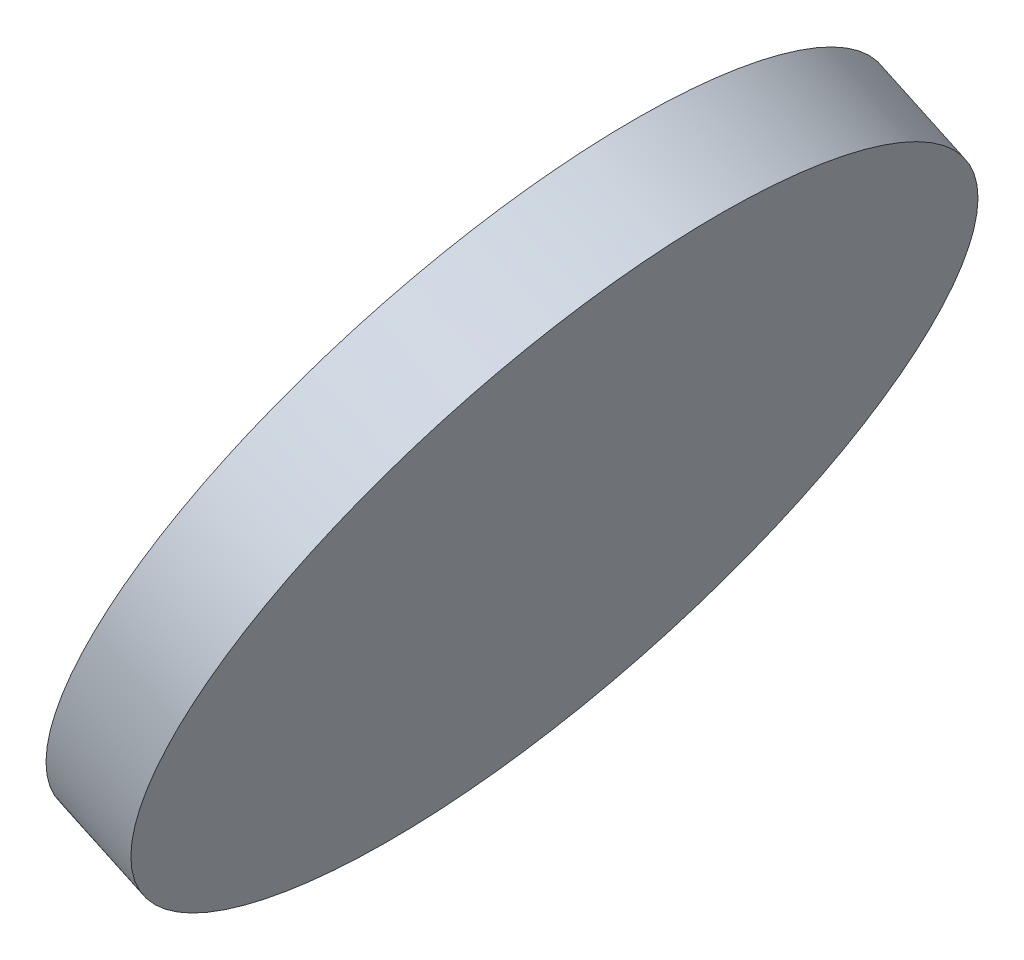
ISO-10303-21;
HEADER;
FILE_DESCRIPTION(('STEP AP214'),'2;1');
FILE_NAME('part.step','',(''),(''),'','','');
FILE_SCHEMA(('AUTOMOTIVE_DESIGN { 1 0 10303 214 1 1 1 1 }'));
ENDSEC;
DATA;
#1=APPLICATION_CONTEXT('core data for automotive mechanical design processes');
#2=APPLICATION_PROTOCOL_DEFINITION('international standard','automotive_design',2000,#1);
#3=PRODUCT_CONTEXT('',#1,'mechanical');
#4=PRODUCT('Part','Part','',(#3));
#5=PRODUCT_RELATED_PRODUCT_CATEGORY('part','',(#4));
#6=PRODUCT_DEFINITION_FORMATION('','',#4);
#7=PRODUCT_DEFINITION_CONTEXT('part definition',#1,'design');
#8=PRODUCT_DEFINITION('design','',#6,#7);
#9=PRODUCT_DEFINITION_SHAPE('','',#8);
#10=(LENGTH_UNIT() NAMED_UNIT(*) SI_UNIT(.MILLI.,.METRE.));
#11=(NAMED_UNIT(*) PLANE_ANGLE_UNIT() SI_UNIT($,.RADIAN.));
#12=(NAMED_UNIT(*) SI_UNIT($,.STERADIAN.) SOLID_ANGLE_UNIT());
#13=UNCERTAINTY_MEASURE_WITH_UNIT(LENGTH_MEASURE(1.E-05),#10,'distance_accuracy_value','');
#14=(GEOMETRIC_REPRESENTATION_CONTEXT(3) GLOBAL_UNCERTAINTY_ASSIGNED_CONTEXT((#13)) GLOBAL_UNIT_ASSIGNED_CONTEXT((#10,
#11,#12)) REPRESENTATION_CONTEXT('',''));
#15=CARTESIAN_POINT('',(0.,0.,0.));
#16=DIRECTION('',(0.,0.,1.));
#17=DIRECTION('',(1.,0.,0.));
#18=AXIS2_PLACEMENT_3D('',#15,#16,#17);
#19=CARTESIAN_POINT('',(-129.21892336121,-57.2321452148781,15.85));
#20=DIRECTION('',(0.90630778703668,-0.422618261740635,0.));
#21=DIRECTION('',(0.41267452143553,0.884983367136628,-0.215648276713435));
#22=AXIS2_PLACEMENT_3D('',#19,#20,#21);
#23=CYLINDRICAL_SURFACE('',#22,12.4999999999977);
#24=CARTESIAN_POINT('',(-129.21892336121,-57.2321452148781,15.85));
#25=DIRECTION('',(0.90630778703668,-0.422618261740635,0.));
#26=DIRECTION('',(-0.41267452143553,-0.884983367136628,0.215648276713435));
#27=AXIS2_PLACEMENT_3D('',#24,#25,#26);
#28=CIRCLE('',#27,12.4999999999977);
#29=CARTESIAN_POINT('',(-134.377354879153,-68.2944373040839,18.5456034589174));
#30=VERTEX_POINT('',#29);
#31=EDGE_CURVE('E10',#30,#30,#28,.T.);
#32=ORIENTED_EDGE('',*,*,#31,.T.);
#33=EDGE_LOOP('',(#32));
#34=FACE_BOUND('',#33,.T.);
#35=CARTESIAN_POINT('',(-126.5000000001,-58.5000000001,15.85));
#36=DIRECTION('',(0.90630778703668,-0.422618261740635,0.));
#37=DIRECTION('',(-0.41267452143553,-0.884983367136628,0.215648276713435));
#38=AXIS2_PLACEMENT_3D('',#35,#36,#37);
#39=CIRCLE('',#38,12.4999999999977);
#40=CARTESIAN_POINT('',(-131.658431518043,-69.5622920893058,18.5456034589174));
#41=VERTEX_POINT('',#40);
#42=EDGE_CURVE('E18',#41,#41,#39,.T.);
#43=ORIENTED_EDGE('',*,*,#42,.F.);
#44=EDGE_LOOP('',(#43));
#45=FACE_BOUND('',#44,.T.);
#46=ADVANCED_FACE('F15',(#34,#45),#23,.T.);
#47=CARTESIAN_POINT('',(-129.21892336121,-57.2321452148781,15.85));
#48=DIRECTION('',(0.90630778703668,-0.422618261740635,0.));
#49=DIRECTION('',(0.41267452143553,0.884983367136628,-0.215648276713435));
#50=AXIS2_PLACEMENT_3D('',#47,#48,#49);
#51=PLANE('',#50);
#52=ORIENTED_EDGE('',*,*,#31,.F.);
#53=EDGE_LOOP('',(#52));
#54=FACE_BOUND('',#53,.T.);
#55=ADVANCED_FACE('F30',(#54),#51,.F.);
#56=CARTESIAN_POINT('',(-126.5000000001,-58.5000000001,15.85));
#57=DIRECTION('',(0.90630778703668,-0.422618261740635,0.));
#58=DIRECTION('',(0.41267452143553,0.884983367136628,-0.215648276713435));
#59=AXIS2_PLACEMENT_3D('',#56,#57,#58);
#60=PLANE('',#59);
#61=ORIENTED_EDGE('',*,*,#42,.T.);
#62=EDGE_LOOP('',(#61));
#63=FACE_BOUND('',#62,.T.);
#64=ADVANCED_FACE('F27',(#63),#60,.T.);
#65=CLOSED_SHELL('',(#46,#55,#64));
#66=MANIFOLD_SOLID_BREP('B1',#65);
#67=ADVANCED_BREP_SHAPE_REPRESENTATION('',(#18,#66),#14);
#68=SHAPE_DEFINITION_REPRESENTATION(#9,#67);
ENDSEC;
END-ISO-10303-21;
